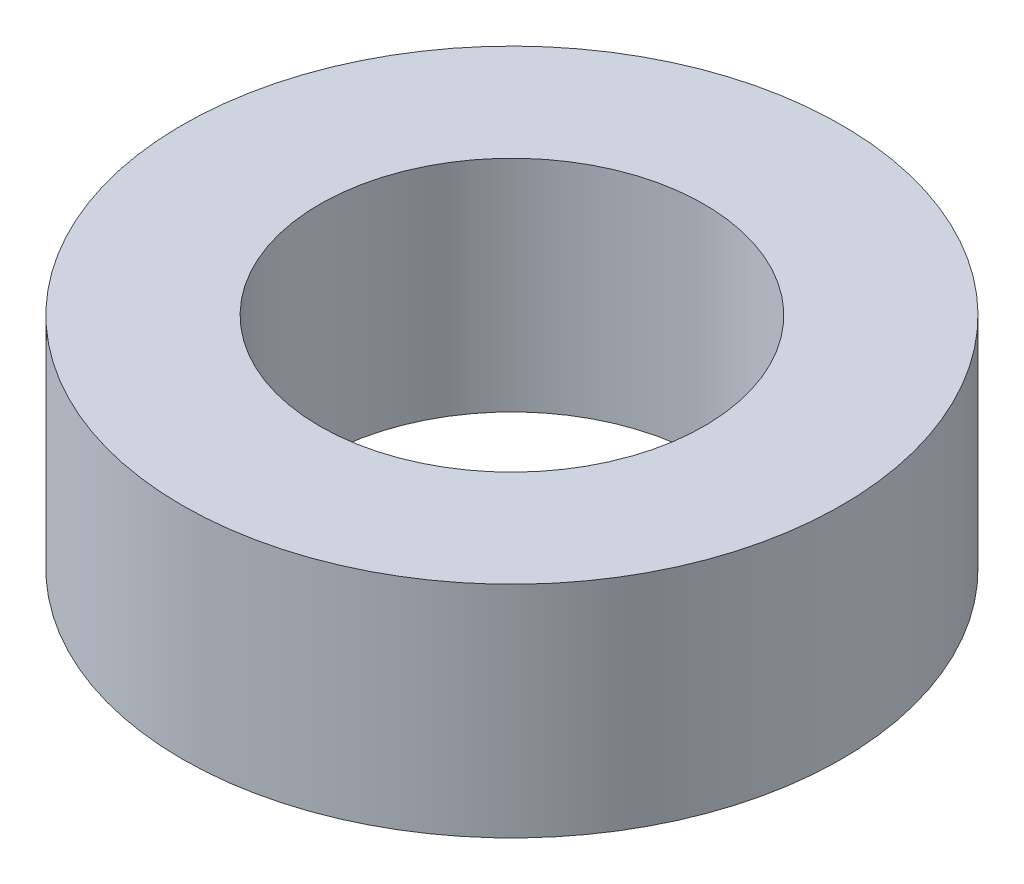
ISO-10303-21;
HEADER;
FILE_DESCRIPTION(('STEP AP214'),'2;1');
FILE_NAME('part.step','',(''),(''),'','','');
FILE_SCHEMA(('AUTOMOTIVE_DESIGN { 1 0 10303 214 1 1 1 1 }'));
ENDSEC;
DATA;
#1=APPLICATION_CONTEXT('core data for automotive mechanical design processes');
#2=APPLICATION_PROTOCOL_DEFINITION('international standard','automotive_design',2000,#1);
#3=PRODUCT_CONTEXT('',#1,'mechanical');
#4=PRODUCT('Part','Part','',(#3));
#5=PRODUCT_RELATED_PRODUCT_CATEGORY('part','',(#4));
#6=PRODUCT_DEFINITION_FORMATION('','',#4);
#7=PRODUCT_DEFINITION_CONTEXT('part definition',#1,'design');
#8=PRODUCT_DEFINITION('design','',#6,#7);
#9=PRODUCT_DEFINITION_SHAPE('','',#8);
#10=(LENGTH_UNIT() NAMED_UNIT(*) SI_UNIT(.MILLI.,.METRE.));
#11=(NAMED_UNIT(*) PLANE_ANGLE_UNIT() SI_UNIT($,.RADIAN.));
#12=(NAMED_UNIT(*) SI_UNIT($,.STERADIAN.) SOLID_ANGLE_UNIT());
#13=UNCERTAINTY_MEASURE_WITH_UNIT(LENGTH_MEASURE(1.E-05),#10,'distance_accuracy_value','');
#14=(GEOMETRIC_REPRESENTATION_CONTEXT(3) GLOBAL_UNCERTAINTY_ASSIGNED_CONTEXT((#13)) GLOBAL_UNIT_ASSIGNED_CONTEXT((#10,
#11,#12)) REPRESENTATION_CONTEXT('',''));
#15=CARTESIAN_POINT('',(0.,0.,0.));
#16=DIRECTION('',(0.,0.,1.));
#17=DIRECTION('',(1.,0.,0.));
#18=AXIS2_PLACEMENT_3D('',#15,#16,#17);
#19=CARTESIAN_POINT('',(0.,20.,0.));
#20=DIRECTION('',(0.,-1.,0.));
#21=DIRECTION('',(0.,0.,-1.));
#22=AXIS2_PLACEMENT_3D('',#19,#20,#21);
#23=CYLINDRICAL_SURFACE('',#22,30.);
#24=CARTESIAN_POINT('',(0.,20.,0.));
#25=DIRECTION('',(0.,1.,0.));
#26=DIRECTION('',(0.,0.,1.));
#27=AXIS2_PLACEMENT_3D('',#24,#25,#26);
#28=CIRCLE('',#27,30.);
#29=CARTESIAN_POINT('',(0.,20.,30.));
#30=VERTEX_POINT('',#29);
#31=EDGE_CURVE('E10',#30,#30,#28,.T.);
#32=ORIENTED_EDGE('',*,*,#31,.F.);
#33=EDGE_LOOP('',(#32));
#34=FACE_BOUND('',#33,.T.);
#35=CARTESIAN_POINT('',(0.,0.,0.));
#36=DIRECTION('',(0.,1.,0.));
#37=DIRECTION('',(0.,0.,1.));
#38=AXIS2_PLACEMENT_3D('',#35,#36,#37);
#39=CIRCLE('',#38,30.);
#40=CARTESIAN_POINT('',(0.,0.,30.));
#41=VERTEX_POINT('',#40);
#42=EDGE_CURVE('E37',#41,#41,#39,.T.);
#43=ORIENTED_EDGE('',*,*,#42,.T.);
#44=EDGE_LOOP('',(#43));
#45=FACE_BOUND('',#44,.T.);
#46=ADVANCED_FACE('F40',(#34,#45),#23,.T.);
#47=CARTESIAN_POINT('',(0.,20.,0.));
#48=DIRECTION('',(0.,1.,0.));
#49=DIRECTION('',(0.,0.,1.));
#50=AXIS2_PLACEMENT_3D('',#47,#48,#49);
#51=PLANE('',#50);
#52=CARTESIAN_POINT('',(0.,20.,0.));
#53=DIRECTION('',(0.,1.,0.));
#54=DIRECTION('',(0.,0.,1.));
#55=AXIS2_PLACEMENT_3D('',#52,#53,#54);
#56=CIRCLE('',#55,17.5);
#57=CARTESIAN_POINT('',(0.,20.,17.5));
#58=VERTEX_POINT('',#57);
#59=EDGE_CURVE('E50',#58,#58,#56,.T.);
#60=ORIENTED_EDGE('',*,*,#59,.F.);
#61=EDGE_LOOP('',(#60));
#62=FACE_BOUND('',#61,.T.);
#63=ORIENTED_EDGE('',*,*,#31,.T.);
#64=EDGE_LOOP('',(#63));
#65=FACE_BOUND('',#64,.T.);
#66=ADVANCED_FACE('F59',(#62,#65),#51,.T.);
#67=CARTESIAN_POINT('',(0.,0.,0.));
#68=DIRECTION('',(0.,1.,0.));
#69=DIRECTION('',(0.,0.,1.));
#70=AXIS2_PLACEMENT_3D('',#67,#68,#69);
#71=PLANE('',#70);
#72=CARTESIAN_POINT('',(0.,0.,0.));
#73=DIRECTION('',(0.,1.,0.));
#74=DIRECTION('',(0.,0.,1.));
#75=AXIS2_PLACEMENT_3D('',#72,#73,#74);
#76=CIRCLE('',#75,17.5);
#77=CARTESIAN_POINT('',(0.,0.,17.5));
#78=VERTEX_POINT('',#77);
#79=EDGE_CURVE('E47',#78,#78,#76,.T.);
#80=ORIENTED_EDGE('',*,*,#79,.T.);
#81=EDGE_LOOP('',(#80));
#82=FACE_BOUND('',#81,.T.);
#83=ORIENTED_EDGE('',*,*,#42,.F.);
#84=EDGE_LOOP('',(#83));
#85=FACE_BOUND('',#84,.T.);
#86=ADVANCED_FACE('F58',(#82,#85),#71,.F.);
#87=CARTESIAN_POINT('',(0.,20.,0.));
#88=DIRECTION('',(0.,-1.,0.));
#89=DIRECTION('',(0.,0.,-1.));
#90=AXIS2_PLACEMENT_3D('',#87,#88,#89);
#91=CYLINDRICAL_SURFACE('',#90,17.5);
#92=ORIENTED_EDGE('',*,*,#59,.T.);
#93=EDGE_LOOP('',(#92));
#94=FACE_BOUND('',#93,.T.);
#95=ORIENTED_EDGE('',*,*,#79,.F.);
#96=EDGE_LOOP('',(#95));
#97=FACE_BOUND('',#96,.T.);
#98=ADVANCED_FACE('F54',(#94,#97),#91,.F.);
#99=CLOSED_SHELL('',(#46,#66,#86,#98));
#100=MANIFOLD_SOLID_BREP('B2',#99);
#101=ADVANCED_BREP_SHAPE_REPRESENTATION('',(#18,#100),#14);
#102=SHAPE_DEFINITION_REPRESENTATION(#9,#101);
ENDSEC;
END-ISO-10303-21;
